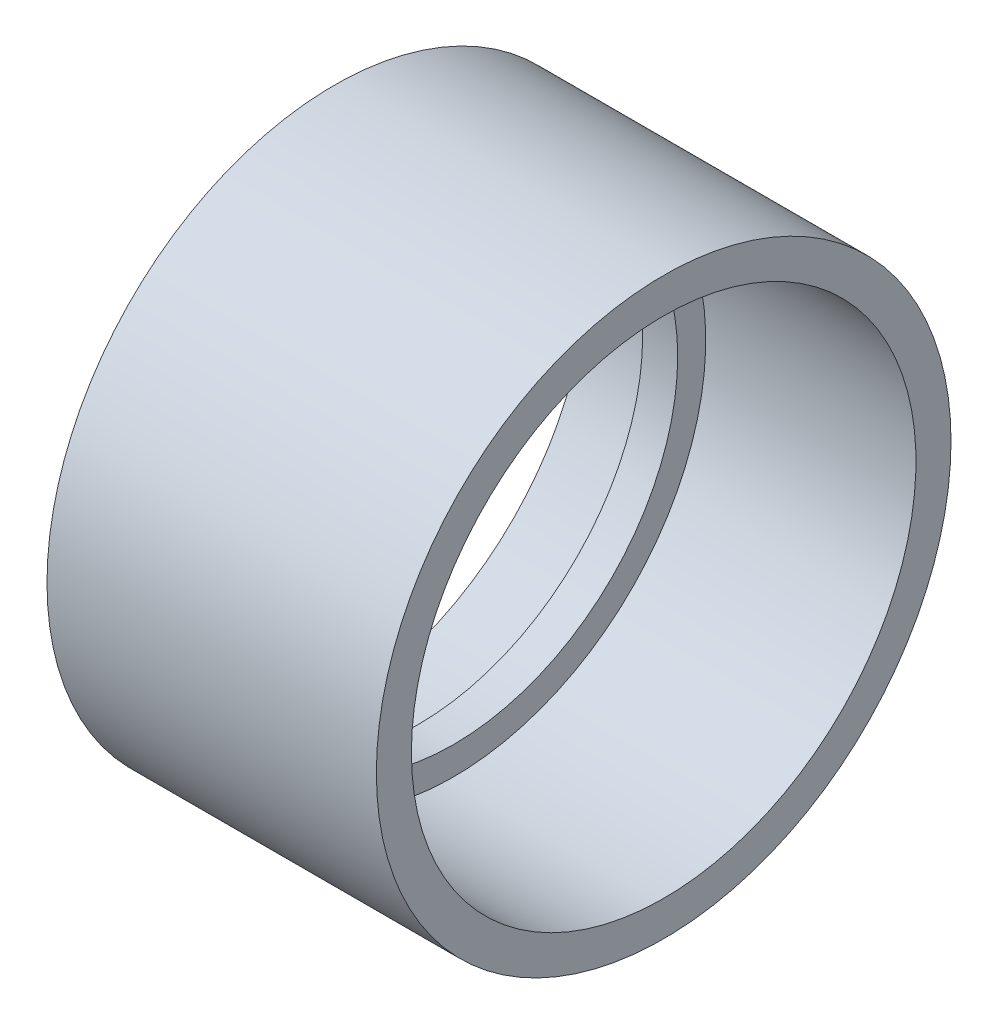
ISO-10303-21;
HEADER;
FILE_DESCRIPTION(('STEP AP214'),'2;1');
FILE_NAME('part.step','',(''),(''),'','','');
FILE_SCHEMA(('AUTOMOTIVE_DESIGN { 1 0 10303 214 1 1 1 1 }'));
ENDSEC;
DATA;
#1=APPLICATION_CONTEXT('core data for automotive mechanical design processes');
#2=APPLICATION_PROTOCOL_DEFINITION('international standard','automotive_design',2000,#1);
#3=PRODUCT_CONTEXT('',#1,'mechanical');
#4=PRODUCT('Part','Part','',(#3));
#5=PRODUCT_RELATED_PRODUCT_CATEGORY('part','',(#4));
#6=PRODUCT_DEFINITION_FORMATION('','',#4);
#7=PRODUCT_DEFINITION_CONTEXT('part definition',#1,'design');
#8=PRODUCT_DEFINITION('design','',#6,#7);
#9=PRODUCT_DEFINITION_SHAPE('','',#8);
#10=(LENGTH_UNIT() NAMED_UNIT(*) SI_UNIT(.MILLI.,.METRE.));
#11=(NAMED_UNIT(*) PLANE_ANGLE_UNIT() SI_UNIT($,.RADIAN.));
#12=(NAMED_UNIT(*) SI_UNIT($,.STERADIAN.) SOLID_ANGLE_UNIT());
#13=UNCERTAINTY_MEASURE_WITH_UNIT(LENGTH_MEASURE(1.E-05),#10,'distance_accuracy_value','');
#14=(GEOMETRIC_REPRESENTATION_CONTEXT(3) GLOBAL_UNCERTAINTY_ASSIGNED_CONTEXT((#13)) GLOBAL_UNIT_ASSIGNED_CONTEXT((#10,
#11,#12)) REPRESENTATION_CONTEXT('',''));
#15=CARTESIAN_POINT('',(0.,0.,0.));
#16=DIRECTION('',(0.,0.,1.));
#17=DIRECTION('',(1.,0.,0.));
#18=AXIS2_PLACEMENT_3D('',#15,#16,#17);
#19=CARTESIAN_POINT('',(-5.,36.,0.));
#20=DIRECTION('',(1.,0.,0.));
#21=DIRECTION('',(0.,0.,-1.));
#22=AXIS2_PLACEMENT_3D('',#19,#20,#21);
#23=PLANE('',#22);
#24=CARTESIAN_POINT('',(-5.,0.,0.));
#25=DIRECTION('',(-1.,0.,0.));
#26=DIRECTION('',(0.,0.,1.));
#27=AXIS2_PLACEMENT_3D('',#24,#25,#26);
#28=CIRCLE('',#27,32.);
#29=CARTESIAN_POINT('',(-5.,0.,32.));
#30=VERTEX_POINT('',#29);
#31=EDGE_CURVE('E10',#30,#30,#28,.T.);
#32=ORIENTED_EDGE('',*,*,#31,.F.);
#33=EDGE_LOOP('',(#32));
#34=FACE_BOUND('',#33,.T.);
#35=CARTESIAN_POINT('',(-5.,0.,0.));
#36=DIRECTION('',(-1.,0.,0.));
#37=DIRECTION('',(0.,0.,1.));
#38=AXIS2_PLACEMENT_3D('',#35,#36,#37);
#39=CIRCLE('',#38,36.);
#40=CARTESIAN_POINT('',(-5.,0.,36.));
#41=VERTEX_POINT('',#40);
#42=EDGE_CURVE('E62',#41,#41,#39,.T.);
#43=ORIENTED_EDGE('',*,*,#42,.T.);
#44=EDGE_LOOP('',(#43));
#45=FACE_BOUND('',#44,.T.);
#46=ADVANCED_FACE('F34',(#34,#45),#23,.F.);
#47=CARTESIAN_POINT('',(-1000.,0.,0.));
#48=DIRECTION('',(-1.,0.,0.));
#49=DIRECTION('',(0.,0.,1.));
#50=AXIS2_PLACEMENT_3D('',#47,#48,#49);
#51=CYLINDRICAL_SURFACE('',#50,32.);
#52=CARTESIAN_POINT('',(0.,0.,0.));
#53=DIRECTION('',(-1.,0.,0.));
#54=DIRECTION('',(0.,0.,1.));
#55=AXIS2_PLACEMENT_3D('',#52,#53,#54);
#56=CIRCLE('',#55,32.);
#57=CARTESIAN_POINT('',(0.,0.,32.));
#58=VERTEX_POINT('',#57);
#59=EDGE_CURVE('E40',#58,#58,#56,.T.);
#60=ORIENTED_EDGE('',*,*,#59,.F.);
#61=EDGE_LOOP('',(#60));
#62=FACE_BOUND('',#61,.T.);
#63=ORIENTED_EDGE('',*,*,#31,.T.);
#64=EDGE_LOOP('',(#63));
#65=FACE_BOUND('',#64,.T.);
#66=ADVANCED_FACE('F99',(#62,#65),#51,.F.);
#67=CARTESIAN_POINT('',(0.,32.,0.));
#68=DIRECTION('',(-1.,0.,0.));
#69=DIRECTION('',(0.,0.,1.));
#70=AXIS2_PLACEMENT_3D('',#67,#68,#69);
#71=PLANE('',#70);
#72=CARTESIAN_POINT('',(0.,0.,0.));
#73=DIRECTION('',(-1.,0.,0.));
#74=DIRECTION('',(0.,0.,1.));
#75=AXIS2_PLACEMENT_3D('',#72,#73,#74);
#76=CIRCLE('',#75,36.);
#77=CARTESIAN_POINT('',(0.,0.,36.));
#78=VERTEX_POINT('',#77);
#79=EDGE_CURVE('E44',#78,#78,#76,.T.);
#80=ORIENTED_EDGE('',*,*,#79,.F.);
#81=EDGE_LOOP('',(#80));
#82=FACE_BOUND('',#81,.T.);
#83=ORIENTED_EDGE('',*,*,#59,.T.);
#84=EDGE_LOOP('',(#83));
#85=FACE_BOUND('',#84,.T.);
#86=ADVANCED_FACE('F94',(#82,#85),#71,.F.);
#87=CARTESIAN_POINT('',(-1000.,0.,0.));
#88=DIRECTION('',(-1.,0.,0.));
#89=DIRECTION('',(0.,0.,1.));
#90=AXIS2_PLACEMENT_3D('',#87,#88,#89);
#91=CYLINDRICAL_SURFACE('',#90,36.);
#92=CARTESIAN_POINT('',(29.9999999999998,0.,0.));
#93=DIRECTION('',(-1.,0.,0.));
#94=DIRECTION('',(0.,0.,1.));
#95=AXIS2_PLACEMENT_3D('',#92,#93,#94);
#96=CIRCLE('',#95,36.);
#97=CARTESIAN_POINT('',(29.9999999999998,0.,36.));
#98=VERTEX_POINT('',#97);
#99=EDGE_CURVE('E48',#98,#98,#96,.T.);
#100=ORIENTED_EDGE('',*,*,#99,.F.);
#101=EDGE_LOOP('',(#100));
#102=FACE_BOUND('',#101,.T.);
#103=ORIENTED_EDGE('',*,*,#79,.T.);
#104=EDGE_LOOP('',(#103));
#105=FACE_BOUND('',#104,.T.);
#106=ADVANCED_FACE('F88',(#102,#105),#91,.F.);
#107=CARTESIAN_POINT('',(29.9999999999999,36.,0.));
#108=DIRECTION('',(-1.,0.,0.));
#109=DIRECTION('',(0.,0.,1.));
#110=AXIS2_PLACEMENT_3D('',#107,#108,#109);
#111=PLANE('',#110);
#112=CARTESIAN_POINT('',(29.9999999999998,0.,0.));
#113=DIRECTION('',(-1.,0.,0.));
#114=DIRECTION('',(0.,0.,1.));
#115=AXIS2_PLACEMENT_3D('',#112,#113,#114);
#116=CIRCLE('',#115,41.);
#117=CARTESIAN_POINT('',(29.9999999999998,0.,41.));
#118=VERTEX_POINT('',#117);
#119=EDGE_CURVE('E53',#118,#118,#116,.T.);
#120=ORIENTED_EDGE('',*,*,#119,.F.);
#121=EDGE_LOOP('',(#120));
#122=FACE_BOUND('',#121,.T.);
#123=ORIENTED_EDGE('',*,*,#99,.T.);
#124=EDGE_LOOP('',(#123));
#125=FACE_BOUND('',#124,.T.);
#126=ADVANCED_FACE('F82',(#122,#125),#111,.F.);
#127=CARTESIAN_POINT('',(-1000.,0.,0.));
#128=DIRECTION('',(-1.,0.,0.));
#129=DIRECTION('',(0.,0.,1.));
#130=AXIS2_PLACEMENT_3D('',#127,#128,#129);
#131=CYLINDRICAL_SURFACE('',#130,41.);
#132=CARTESIAN_POINT('',(-17.,0.,0.));
#133=DIRECTION('',(-1.,0.,0.));
#134=DIRECTION('',(0.,0.,1.));
#135=AXIS2_PLACEMENT_3D('',#132,#133,#134);
#136=CIRCLE('',#135,41.);
#137=CARTESIAN_POINT('',(-17.,0.,41.));
#138=VERTEX_POINT('',#137);
#139=EDGE_CURVE('E56',#138,#138,#136,.T.);
#140=ORIENTED_EDGE('',*,*,#139,.F.);
#141=EDGE_LOOP('',(#140));
#142=FACE_BOUND('',#141,.T.);
#143=ORIENTED_EDGE('',*,*,#119,.T.);
#144=EDGE_LOOP('',(#143));
#145=FACE_BOUND('',#144,.T.);
#146=ADVANCED_FACE('F76',(#142,#145),#131,.T.);
#147=CARTESIAN_POINT('',(-17.,41.,0.));
#148=DIRECTION('',(1.,0.,0.));
#149=DIRECTION('',(0.,0.,-1.));
#150=AXIS2_PLACEMENT_3D('',#147,#148,#149);
#151=PLANE('',#150);
#152=CARTESIAN_POINT('',(-17.,0.,0.));
#153=DIRECTION('',(-1.,0.,0.));
#154=DIRECTION('',(0.,0.,1.));
#155=AXIS2_PLACEMENT_3D('',#152,#153,#154);
#156=CIRCLE('',#155,36.);
#157=CARTESIAN_POINT('',(-17.,0.,36.));
#158=VERTEX_POINT('',#157);
#159=EDGE_CURVE('E59',#158,#158,#156,.T.);
#160=ORIENTED_EDGE('',*,*,#159,.F.);
#161=EDGE_LOOP('',(#160));
#162=FACE_BOUND('',#161,.T.);
#163=ORIENTED_EDGE('',*,*,#139,.T.);
#164=EDGE_LOOP('',(#163));
#165=FACE_BOUND('',#164,.T.);
#166=ADVANCED_FACE('F70',(#162,#165),#151,.F.);
#167=CARTESIAN_POINT('',(-1000.,0.,0.));
#168=DIRECTION('',(-1.,0.,0.));
#169=DIRECTION('',(0.,0.,1.));
#170=AXIS2_PLACEMENT_3D('',#167,#168,#169);
#171=CYLINDRICAL_SURFACE('',#170,36.);
#172=ORIENTED_EDGE('',*,*,#42,.F.);
#173=EDGE_LOOP('',(#172));
#174=FACE_BOUND('',#173,.T.);
#175=ORIENTED_EDGE('',*,*,#159,.T.);
#176=EDGE_LOOP('',(#175));
#177=FACE_BOUND('',#176,.T.);
#178=ADVANCED_FACE('F67',(#174,#177),#171,.F.);
#179=CLOSED_SHELL('',(#46,#66,#86,#106,#126,#146,#166,#178));
#180=MANIFOLD_SOLID_BREP('B2',#179);
#181=ADVANCED_BREP_SHAPE_REPRESENTATION('',(#18,#180),#14);
#182=SHAPE_DEFINITION_REPRESENTATION(#9,#181);
ENDSEC;
END-ISO-10303-21;
